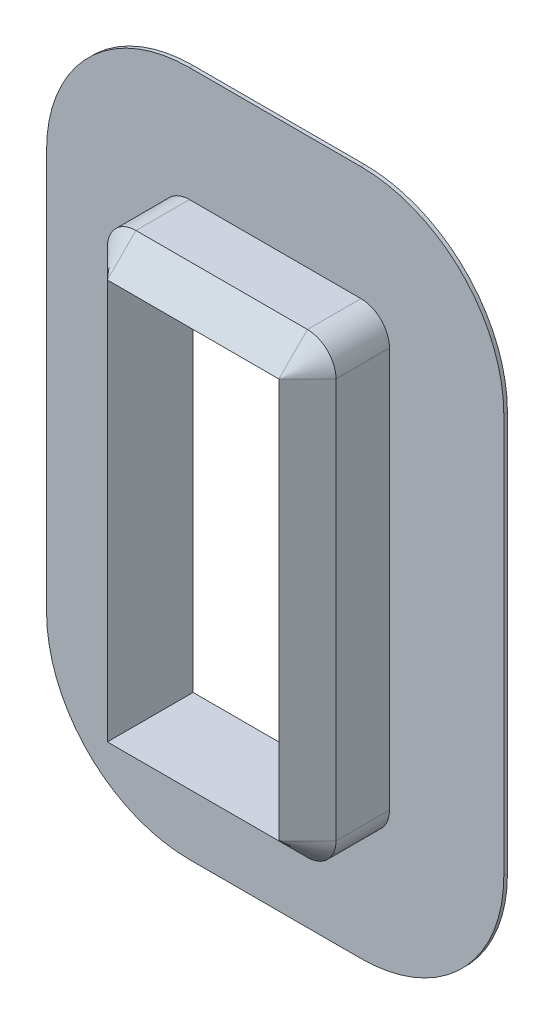
ISO-10303-21;
HEADER;
FILE_DESCRIPTION(('STEP AP214'),'2;1');
FILE_NAME('part.step','',(''),(''),'','','');
FILE_SCHEMA(('AUTOMOTIVE_DESIGN { 1 0 10303 214 1 1 1 1 }'));
ENDSEC;
DATA;
#1=APPLICATION_CONTEXT('core data for automotive mechanical design processes');
#2=APPLICATION_PROTOCOL_DEFINITION('international standard','automotive_design',2000,#1);
#3=PRODUCT_CONTEXT('',#1,'mechanical');
#4=PRODUCT('Part','Part','',(#3));
#5=PRODUCT_RELATED_PRODUCT_CATEGORY('part','',(#4));
#6=PRODUCT_DEFINITION_FORMATION('','',#4);
#7=PRODUCT_DEFINITION_CONTEXT('part definition',#1,'design');
#8=PRODUCT_DEFINITION('design','',#6,#7);
#9=PRODUCT_DEFINITION_SHAPE('','',#8);
#10=(LENGTH_UNIT() NAMED_UNIT(*) SI_UNIT(.MILLI.,.METRE.));
#11=(NAMED_UNIT(*) PLANE_ANGLE_UNIT() SI_UNIT($,.RADIAN.));
#12=(NAMED_UNIT(*) SI_UNIT($,.STERADIAN.) SOLID_ANGLE_UNIT());
#13=UNCERTAINTY_MEASURE_WITH_UNIT(LENGTH_MEASURE(1.E-05),#10,'distance_accuracy_value','');
#14=(GEOMETRIC_REPRESENTATION_CONTEXT(3) GLOBAL_UNCERTAINTY_ASSIGNED_CONTEXT((#13)) GLOBAL_UNIT_ASSIGNED_CONTEXT((#10,
#11,#12)) REPRESENTATION_CONTEXT('',''));
#15=CARTESIAN_POINT('',(0.,0.,0.));
#16=DIRECTION('',(0.,0.,1.));
#17=DIRECTION('',(1.,0.,0.));
#18=AXIS2_PLACEMENT_3D('',#15,#16,#17);
#19=CARTESIAN_POINT('',(0.,146.05,9.525));
#20=DIRECTION('',(0.,1.,0.));
#21=DIRECTION('',(0.,0.,1.));
#22=AXIS2_PLACEMENT_3D('',#19,#20,#21);
#23=PLANE('',#22);
#24=DIRECTION('',(0.,0.,-1.));
#25=VECTOR('',#24,1.);
#26=CARTESIAN_POINT('',(-9.52499999999998,146.05,9.525));
#27=LINE('',#26,#25);
#28=CARTESIAN_POINT('',(-9.52499999999998,146.05,6.35));
#29=VERTEX_POINT('',#28);
#30=CARTESIAN_POINT('',(-9.52499999999998,146.05,0.));
#31=VERTEX_POINT('',#30);
#32=EDGE_CURVE('E266',#29,#31,#27,.T.);
#33=ORIENTED_EDGE('',*,*,#32,.F.);
#34=DIRECTION('',(1.,0.,0.));
#35=VECTOR('',#34,1.);
#36=CARTESIAN_POINT('',(0.,146.05,6.35));
#37=LINE('',#36,#35);
#38=CARTESIAN_POINT('',(9.52499999999997,146.05,6.35));
#39=VERTEX_POINT('',#38);
#40=EDGE_CURVE('E12',#29,#39,#37,.T.);
#41=ORIENTED_EDGE('',*,*,#40,.T.);
#42=DIRECTION('',(0.,0.,-1.));
#43=VECTOR('',#42,1.);
#44=CARTESIAN_POINT('',(9.52499999999997,146.05,9.525));
#45=LINE('',#44,#43);
#46=CARTESIAN_POINT('',(9.52499999999997,146.05,0.));
#47=VERTEX_POINT('',#46);
#48=EDGE_CURVE('E158',#39,#47,#45,.T.);
#49=ORIENTED_EDGE('',*,*,#48,.T.);
#50=DIRECTION('',(1.,0.,0.));
#51=VECTOR('',#50,1.);
#52=CARTESIAN_POINT('',(0.,146.05,0.));
#53=LINE('',#52,#51);
#54=EDGE_CURVE('E219',#31,#47,#53,.T.);
#55=ORIENTED_EDGE('',*,*,#54,.F.);
#56=EDGE_LOOP('',(#33,#41,#49,#55));
#57=FACE_BOUND('',#56,.T.);
#58=ADVANCED_FACE('F56',(#57),#23,.T.);
#59=CARTESIAN_POINT('',(-9.52500000000001,142.875,9.525));
#60=DIRECTION('',(0.,0.,-1.));
#61=DIRECTION('',(-1.,0.,0.));
#62=AXIS2_PLACEMENT_3D('',#59,#60,#61);
#63=CYLINDRICAL_SURFACE('',#62,3.17500000000001);
#64=DIRECTION('',(0.,0.,-1.));
#65=VECTOR('',#64,1.);
#66=CARTESIAN_POINT('',(-12.7,142.875,9.525));
#67=LINE('',#66,#65);
#68=CARTESIAN_POINT('',(-12.7,142.875,6.35));
#69=VERTEX_POINT('',#68);
#70=CARTESIAN_POINT('',(-12.7,142.875,0.));
#71=VERTEX_POINT('',#70);
#72=EDGE_CURVE('E263',#69,#71,#67,.T.);
#73=ORIENTED_EDGE('',*,*,#72,.F.);
#74=CARTESIAN_POINT('',(-9.52500000000001,142.875,6.35));
#75=DIRECTION('',(0.,0.,1.));
#76=DIRECTION('',(1.,0.,0.));
#77=AXIS2_PLACEMENT_3D('',#74,#75,#76);
#78=CIRCLE('',#77,3.17500000000001);
#79=EDGE_CURVE('E67',#69,#29,#78,.F.);
#80=ORIENTED_EDGE('',*,*,#79,.T.);
#81=ORIENTED_EDGE('',*,*,#32,.T.);
#82=CARTESIAN_POINT('',(-9.52500000000001,142.875,0.));
#83=DIRECTION('',(0.,0.,1.));
#84=DIRECTION('',(1.,0.,0.));
#85=AXIS2_PLACEMENT_3D('',#82,#83,#84);
#86=CIRCLE('',#85,3.17500000000001);
#87=EDGE_CURVE('E223',#31,#71,#86,.T.);
#88=ORIENTED_EDGE('',*,*,#87,.T.);
#89=EDGE_LOOP('',(#73,#80,#81,#88));
#90=FACE_BOUND('',#89,.T.);
#91=ADVANCED_FACE('F339',(#90),#63,.T.);
#92=CARTESIAN_POINT('',(-12.7,0.,9.525));
#93=DIRECTION('',(1.,0.,0.));
#94=DIRECTION('',(0.,1.,0.));
#95=AXIS2_PLACEMENT_3D('',#92,#93,#94);
#96=PLANE('',#95);
#97=DIRECTION('',(0.,0.,-1.));
#98=VECTOR('',#97,1.);
#99=CARTESIAN_POINT('',(-12.7,98.425,9.525));
#100=LINE('',#99,#98);
#101=CARTESIAN_POINT('',(-12.7,98.425,6.35));
#102=VERTEX_POINT('',#101);
#103=CARTESIAN_POINT('',(-12.7,98.425,0.));
#104=VERTEX_POINT('',#103);
#105=EDGE_CURVE('E260',#102,#104,#100,.T.);
#106=ORIENTED_EDGE('',*,*,#105,.F.);
#107=DIRECTION('',(0.,1.,0.));
#108=VECTOR('',#107,1.);
#109=CARTESIAN_POINT('',(-12.7,142.875,6.35));
#110=LINE('',#109,#108);
#111=EDGE_CURVE('E289',#102,#69,#110,.T.);
#112=ORIENTED_EDGE('',*,*,#111,.T.);
#113=ORIENTED_EDGE('',*,*,#72,.T.);
#114=DIRECTION('',(0.,-1.,0.));
#115=VECTOR('',#114,1.);
#116=CARTESIAN_POINT('',(-12.7,0.,0.));
#117=LINE('',#116,#115);
#118=EDGE_CURVE('E227',#71,#104,#117,.T.);
#119=ORIENTED_EDGE('',*,*,#118,.T.);
#120=EDGE_LOOP('',(#106,#112,#113,#119));
#121=FACE_BOUND('',#120,.T.);
#122=ADVANCED_FACE('F344',(#121),#96,.F.);
#123=CARTESIAN_POINT('',(-9.525,98.425,9.525));
#124=DIRECTION('',(0.,0.,-1.));
#125=DIRECTION('',(-1.,0.,0.));
#126=AXIS2_PLACEMENT_3D('',#123,#124,#125);
#127=CYLINDRICAL_SURFACE('',#126,3.175);
#128=DIRECTION('',(0.,0.,-1.));
#129=VECTOR('',#128,1.);
#130=CARTESIAN_POINT('',(-9.52499999999998,95.25,9.525));
#131=LINE('',#130,#129);
#132=CARTESIAN_POINT('',(-9.52499999999998,95.25,6.35));
#133=VERTEX_POINT('',#132);
#134=CARTESIAN_POINT('',(-9.52499999999998,95.25,0.));
#135=VERTEX_POINT('',#134);
#136=EDGE_CURVE('E257',#133,#135,#131,.T.);
#137=ORIENTED_EDGE('',*,*,#136,.F.);
#138=CARTESIAN_POINT('',(-9.525,98.425,6.35));
#139=DIRECTION('',(0.,0.,1.));
#140=DIRECTION('',(1.,0.,0.));
#141=AXIS2_PLACEMENT_3D('',#138,#139,#140);
#142=CIRCLE('',#141,3.175);
#143=EDGE_CURVE('E283',#133,#102,#142,.F.);
#144=ORIENTED_EDGE('',*,*,#143,.T.);
#145=ORIENTED_EDGE('',*,*,#105,.T.);
#146=CARTESIAN_POINT('',(-9.525,98.425,0.));
#147=DIRECTION('',(0.,0.,1.));
#148=DIRECTION('',(1.,0.,0.));
#149=AXIS2_PLACEMENT_3D('',#146,#147,#148);
#150=CIRCLE('',#149,3.175);
#151=EDGE_CURVE('E231',#104,#135,#150,.T.);
#152=ORIENTED_EDGE('',*,*,#151,.T.);
#153=EDGE_LOOP('',(#137,#144,#145,#152));
#154=FACE_BOUND('',#153,.T.);
#155=ADVANCED_FACE('F377',(#154),#127,.T.);
#156=CARTESIAN_POINT('',(0.,95.25,9.525));
#157=DIRECTION('',(0.,1.,0.));
#158=DIRECTION('',(0.,0.,1.));
#159=AXIS2_PLACEMENT_3D('',#156,#157,#158);
#160=PLANE('',#159);
#161=DIRECTION('',(0.,0.,-1.));
#162=VECTOR('',#161,1.);
#163=CARTESIAN_POINT('',(9.52499999999998,95.25,9.525));
#164=LINE('',#163,#162);
#165=CARTESIAN_POINT('',(9.52499999999998,95.25,6.35));
#166=VERTEX_POINT('',#165);
#167=CARTESIAN_POINT('',(9.52499999999998,95.25,0.));
#168=VERTEX_POINT('',#167);
#169=EDGE_CURVE('E254',#166,#168,#164,.T.);
#170=ORIENTED_EDGE('',*,*,#169,.F.);
#171=DIRECTION('',(-1.,0.,0.));
#172=VECTOR('',#171,1.);
#173=CARTESIAN_POINT('',(-9.52499999999998,95.25,6.35));
#174=LINE('',#173,#172);
#175=EDGE_CURVE('E269',#166,#133,#174,.T.);
#176=ORIENTED_EDGE('',*,*,#175,.T.);
#177=ORIENTED_EDGE('',*,*,#136,.T.);
#178=DIRECTION('',(1.,0.,0.));
#179=VECTOR('',#178,1.);
#180=CARTESIAN_POINT('',(0.,95.25,0.));
#181=LINE('',#180,#179);
#182=EDGE_CURVE('E235',#135,#168,#181,.T.);
#183=ORIENTED_EDGE('',*,*,#182,.T.);
#184=EDGE_LOOP('',(#170,#176,#177,#183));
#185=FACE_BOUND('',#184,.T.);
#186=ADVANCED_FACE('F380',(#185),#160,.F.);
#187=CARTESIAN_POINT('',(9.52500000000001,98.425,9.525));
#188=DIRECTION('',(0.,0.,-1.));
#189=DIRECTION('',(-1.,0.,0.));
#190=AXIS2_PLACEMENT_3D('',#187,#188,#189);
#191=CYLINDRICAL_SURFACE('',#190,3.175);
#192=DIRECTION('',(0.,0.,-1.));
#193=VECTOR('',#192,1.);
#194=CARTESIAN_POINT('',(12.7,98.425,9.525));
#195=LINE('',#194,#193);
#196=CARTESIAN_POINT('',(12.7,98.425,6.35));
#197=VERTEX_POINT('',#196);
#198=CARTESIAN_POINT('',(12.7,98.425,0.));
#199=VERTEX_POINT('',#198);
#200=EDGE_CURVE('E251',#197,#199,#195,.T.);
#201=ORIENTED_EDGE('',*,*,#200,.F.);
#202=CARTESIAN_POINT('',(9.52500000000001,98.425,6.35));
#203=DIRECTION('',(0.,0.,1.));
#204=DIRECTION('',(1.,0.,0.));
#205=AXIS2_PLACEMENT_3D('',#202,#203,#204);
#206=CIRCLE('',#205,3.175);
#207=EDGE_CURVE('E280',#197,#166,#206,.F.);
#208=ORIENTED_EDGE('',*,*,#207,.T.);
#209=ORIENTED_EDGE('',*,*,#169,.T.);
#210=CARTESIAN_POINT('',(9.52500000000001,98.425,0.));
#211=DIRECTION('',(0.,0.,1.));
#212=DIRECTION('',(1.,0.,0.));
#213=AXIS2_PLACEMENT_3D('',#210,#211,#212);
#214=CIRCLE('',#213,3.175);
#215=EDGE_CURVE('E239',#168,#199,#214,.T.);
#216=ORIENTED_EDGE('',*,*,#215,.T.);
#217=EDGE_LOOP('',(#201,#208,#209,#216));
#218=FACE_BOUND('',#217,.T.);
#219=ADVANCED_FACE('F328',(#218),#191,.T.);
#220=CARTESIAN_POINT('',(12.7,0.,9.525));
#221=DIRECTION('',(1.,0.,0.));
#222=DIRECTION('',(0.,1.,0.));
#223=AXIS2_PLACEMENT_3D('',#220,#221,#222);
#224=PLANE('',#223);
#225=DIRECTION('',(0.,0.,-1.));
#226=VECTOR('',#225,1.);
#227=CARTESIAN_POINT('',(12.7,142.875,9.525));
#228=LINE('',#227,#226);
#229=CARTESIAN_POINT('',(12.7,142.875,6.35));
#230=VERTEX_POINT('',#229);
#231=CARTESIAN_POINT('',(12.7,142.875,0.));
#232=VERTEX_POINT('',#231);
#233=EDGE_CURVE('E248',#230,#232,#228,.T.);
#234=ORIENTED_EDGE('',*,*,#233,.F.);
#235=DIRECTION('',(0.,-1.,0.));
#236=VECTOR('',#235,1.);
#237=CARTESIAN_POINT('',(12.7,0.,6.35));
#238=LINE('',#237,#236);
#239=EDGE_CURVE('E286',#230,#197,#238,.T.);
#240=ORIENTED_EDGE('',*,*,#239,.T.);
#241=ORIENTED_EDGE('',*,*,#200,.T.);
#242=DIRECTION('',(0.,-1.,0.));
#243=VECTOR('',#242,1.);
#244=CARTESIAN_POINT('',(12.7,0.,0.));
#245=LINE('',#244,#243);
#246=EDGE_CURVE('E195',#232,#199,#245,.T.);
#247=ORIENTED_EDGE('',*,*,#246,.F.);
#248=EDGE_LOOP('',(#234,#240,#241,#247));
#249=FACE_BOUND('',#248,.T.);
#250=ADVANCED_FACE('F325',(#249),#224,.T.);
#251=CARTESIAN_POINT('',(-9.52500000000001,0.,9.525));
#252=DIRECTION('',(1.,0.,0.));
#253=DIRECTION('',(0.,0.,-1.));
#254=AXIS2_PLACEMENT_3D('',#251,#252,#253);
#255=PLANE('',#254);
#256=DIRECTION('',(0.,-1.,0.));
#257=VECTOR('',#256,1.);
#258=CARTESIAN_POINT('',(-9.52500000000001,0.,0.));
#259=LINE('',#258,#257);
#260=CARTESIAN_POINT('',(-9.52500000000001,142.875,0.));
#261=VERTEX_POINT('',#260);
#262=CARTESIAN_POINT('',(-9.52500000000001,98.425,0.));
#263=VERTEX_POINT('',#262);
#264=EDGE_CURVE('E154',#261,#263,#259,.T.);
#265=ORIENTED_EDGE('',*,*,#264,.F.);
#266=DIRECTION('',(0.,0.,-1.));
#267=VECTOR('',#266,1.);
#268=CARTESIAN_POINT('',(-9.52500000000001,142.875,9.525));
#269=LINE('',#268,#267);
#270=CARTESIAN_POINT('',(-9.52500000000001,142.875,9.525));
#271=VERTEX_POINT('',#270);
#272=EDGE_CURVE('E147',#271,#261,#269,.T.);
#273=ORIENTED_EDGE('',*,*,#272,.F.);
#274=DIRECTION('',(0.,-1.,0.));
#275=VECTOR('',#274,1.);
#276=CARTESIAN_POINT('',(-9.52500000000001,0.,9.525));
#277=LINE('',#276,#275);
#278=CARTESIAN_POINT('',(-9.52500000000001,98.425,9.525));
#279=VERTEX_POINT('',#278);
#280=EDGE_CURVE('E151',#271,#279,#277,.T.);
#281=ORIENTED_EDGE('',*,*,#280,.T.);
#282=DIRECTION('',(0.,0.,-1.));
#283=VECTOR('',#282,1.);
#284=CARTESIAN_POINT('',(-9.52500000000001,98.425,9.525));
#285=LINE('',#284,#283);
#286=EDGE_CURVE('E205',#279,#263,#285,.T.);
#287=ORIENTED_EDGE('',*,*,#286,.T.);
#288=EDGE_LOOP('',(#265,#273,#281,#287));
#289=FACE_BOUND('',#288,.T.);
#290=ADVANCED_FACE('F149',(#289),#255,.T.);
#291=CARTESIAN_POINT('',(0.,142.875,9.525));
#292=DIRECTION('',(0.,1.,0.));
#293=DIRECTION('',(0.,0.,1.));
#294=AXIS2_PLACEMENT_3D('',#291,#292,#293);
#295=PLANE('',#294);
#296=DIRECTION('',(1.,0.,0.));
#297=VECTOR('',#296,1.);
#298=CARTESIAN_POINT('',(0.,142.875,0.));
#299=LINE('',#298,#297);
#300=CARTESIAN_POINT('',(9.525,142.875,0.));
#301=VERTEX_POINT('',#300);
#302=EDGE_CURVE('E208',#261,#301,#299,.T.);
#303=ORIENTED_EDGE('',*,*,#302,.T.);
#304=DIRECTION('',(0.,0.,-1.));
#305=VECTOR('',#304,1.);
#306=CARTESIAN_POINT('',(9.525,142.875,9.525));
#307=LINE('',#306,#305);
#308=CARTESIAN_POINT('',(9.525,142.875,9.525));
#309=VERTEX_POINT('',#308);
#310=EDGE_CURVE('E159',#309,#301,#307,.T.);
#311=ORIENTED_EDGE('',*,*,#310,.F.);
#312=DIRECTION('',(1.,0.,0.));
#313=VECTOR('',#312,1.);
#314=CARTESIAN_POINT('',(0.,142.875,9.525));
#315=LINE('',#314,#313);
#316=EDGE_CURVE('E162',#271,#309,#315,.T.);
#317=ORIENTED_EDGE('',*,*,#316,.F.);
#318=ORIENTED_EDGE('',*,*,#272,.T.);
#319=EDGE_LOOP('',(#303,#311,#317,#318));
#320=FACE_BOUND('',#319,.T.);
#321=ADVANCED_FACE('F164',(#320),#295,.F.);
#322=CARTESIAN_POINT('',(9.52499999999995,0.,9.525));
#323=DIRECTION('',(1.,0.,0.));
#324=DIRECTION('',(0.,1.,0.));
#325=AXIS2_PLACEMENT_3D('',#322,#323,#324);
#326=PLANE('',#325);
#327=DIRECTION('',(0.,-1.,0.));
#328=VECTOR('',#327,1.);
#329=CARTESIAN_POINT('',(9.52499999999995,0.,0.));
#330=LINE('',#329,#328);
#331=CARTESIAN_POINT('',(9.52499999999998,98.425,0.));
#332=VERTEX_POINT('',#331);
#333=EDGE_CURVE('E211',#301,#332,#330,.T.);
#334=ORIENTED_EDGE('',*,*,#333,.T.);
#335=DIRECTION('',(0.,0.,-1.));
#336=VECTOR('',#335,1.);
#337=CARTESIAN_POINT('',(9.52499999999998,98.425,9.525));
#338=LINE('',#337,#336);
#339=CARTESIAN_POINT('',(9.52499999999998,98.425,9.525));
#340=VERTEX_POINT('',#339);
#341=EDGE_CURVE('E272',#340,#332,#338,.T.);
#342=ORIENTED_EDGE('',*,*,#341,.F.);
#343=DIRECTION('',(0.,-1.,0.));
#344=VECTOR('',#343,1.);
#345=CARTESIAN_POINT('',(9.52499999999995,0.,9.525));
#346=LINE('',#345,#344);
#347=EDGE_CURVE('E171',#309,#340,#346,.T.);
#348=ORIENTED_EDGE('',*,*,#347,.F.);
#349=ORIENTED_EDGE('',*,*,#310,.T.);
#350=EDGE_LOOP('',(#334,#342,#348,#349));
#351=FACE_BOUND('',#350,.T.);
#352=ADVANCED_FACE('F359',(#351),#326,.F.);
#353=CARTESIAN_POINT('',(1.43403807347416E-13,98.425,9.525));
#354=DIRECTION('',(0.,1.,0.));
#355=DIRECTION('',(-1.,0.,0.));
#356=AXIS2_PLACEMENT_3D('',#353,#354,#355);
#357=PLANE('',#356);
#358=DIRECTION('',(1.,0.,0.));
#359=VECTOR('',#358,1.);
#360=CARTESIAN_POINT('',(1.43403807347416E-13,98.425,0.));
#361=LINE('',#360,#359);
#362=EDGE_CURVE('E215',#263,#332,#361,.T.);
#363=ORIENTED_EDGE('',*,*,#362,.F.);
#364=ORIENTED_EDGE('',*,*,#286,.F.);
#365=DIRECTION('',(1.,0.,0.));
#366=VECTOR('',#365,1.);
#367=CARTESIAN_POINT('',(1.43403807347416E-13,98.425,9.525));
#368=LINE('',#367,#366);
#369=EDGE_CURVE('E201',#279,#340,#368,.T.);
#370=ORIENTED_EDGE('',*,*,#369,.T.);
#371=ORIENTED_EDGE('',*,*,#341,.T.);
#372=EDGE_LOOP('',(#363,#364,#370,#371));
#373=FACE_BOUND('',#372,.T.);
#374=ADVANCED_FACE('F355',(#373),#357,.T.);
#375=CARTESIAN_POINT('',(9.52499999999999,142.875,9.525));
#376=DIRECTION('',(0.,0.,-1.));
#377=DIRECTION('',(-1.,0.,0.));
#378=AXIS2_PLACEMENT_3D('',#375,#376,#377);
#379=CYLINDRICAL_SURFACE('',#378,3.17500000000001);
#380=ORIENTED_EDGE('',*,*,#48,.F.);
#381=CARTESIAN_POINT('',(9.52499999999999,142.875,6.35));
#382=DIRECTION('',(0.,0.,1.));
#383=DIRECTION('',(1.,0.,0.));
#384=AXIS2_PLACEMENT_3D('',#381,#382,#383);
#385=CIRCLE('',#384,3.17500000000001);
#386=EDGE_CURVE('E292',#39,#230,#385,.F.);
#387=ORIENTED_EDGE('',*,*,#386,.T.);
#388=ORIENTED_EDGE('',*,*,#233,.T.);
#389=CARTESIAN_POINT('',(9.52499999999999,142.875,0.));
#390=DIRECTION('',(0.,0.,1.));
#391=DIRECTION('',(1.,0.,0.));
#392=AXIS2_PLACEMENT_3D('',#389,#390,#391);
#393=CIRCLE('',#392,3.17500000000001);
#394=EDGE_CURVE('E191',#232,#47,#393,.T.);
#395=ORIENTED_EDGE('',*,*,#394,.T.);
#396=EDGE_LOOP('',(#380,#387,#388,#395));
#397=FACE_BOUND('',#396,.T.);
#398=ADVANCED_FACE('F338',(#397),#379,.T.);
#399=CARTESIAN_POINT('',(0.,0.,0.));
#400=DIRECTION('',(0.,0.,1.));
#401=DIRECTION('',(1.,0.,0.));
#402=AXIS2_PLACEMENT_3D('',#399,#400,#401);
#403=PLANE('',#402);
#404=ORIENTED_EDGE('',*,*,#264,.T.);
#405=ORIENTED_EDGE('',*,*,#362,.T.);
#406=ORIENTED_EDGE('',*,*,#333,.F.);
#407=ORIENTED_EDGE('',*,*,#302,.F.);
#408=EDGE_LOOP('',(#404,#405,#406,#407));
#409=FACE_BOUND('',#408,.T.);
#410=ORIENTED_EDGE('',*,*,#54,.T.);
#411=ORIENTED_EDGE('',*,*,#394,.F.);
#412=ORIENTED_EDGE('',*,*,#246,.T.);
#413=ORIENTED_EDGE('',*,*,#215,.F.);
#414=ORIENTED_EDGE('',*,*,#182,.F.);
#415=ORIENTED_EDGE('',*,*,#151,.F.);
#416=ORIENTED_EDGE('',*,*,#118,.F.);
#417=ORIENTED_EDGE('',*,*,#87,.F.);
#418=EDGE_LOOP('',(#410,#411,#412,#413,#414,#415,#416,#417));
#419=FACE_BOUND('',#418,.T.);
#420=ADVANCED_FACE('F334',(#409,#419),#403,.F.);
#421=CARTESIAN_POINT('',(0.,146.05,6.35));
#422=DIRECTION('',(0.,-0.707106781186546,-0.707106781186549));
#423=DIRECTION('',(1.,0.,0.));
#424=AXIS2_PLACEMENT_3D('',#421,#422,#423);
#425=PLANE('',#424);
#426=DIRECTION('',(0.,-0.707106781186549,0.707106781186546));
#427=VECTOR('',#426,1.);
#428=CARTESIAN_POINT('',(9.52499999999997,146.05,6.35));
#429=LINE('',#428,#427);
#430=EDGE_CURVE('E177',#39,#309,#429,.T.);
#431=ORIENTED_EDGE('',*,*,#430,.F.);
#432=ORIENTED_EDGE('',*,*,#40,.F.);
#433=DIRECTION('',(0.,0.707106781186549,-0.707106781186546));
#434=VECTOR('',#433,1.);
#435=CARTESIAN_POINT('',(-9.52500000000001,142.875,9.525));
#436=LINE('',#435,#434);
#437=EDGE_CURVE('E61',#271,#29,#436,.T.);
#438=ORIENTED_EDGE('',*,*,#437,.F.);
#439=ORIENTED_EDGE('',*,*,#316,.T.);
#440=EDGE_LOOP('',(#431,#432,#438,#439));
#441=FACE_BOUND('',#440,.T.);
#442=ADVANCED_FACE('F59',(#441),#425,.F.);
#443=CARTESIAN_POINT('',(-9.52500000000001,142.875,6.35));
#444=DIRECTION('',(0.,0.,-1.));
#445=DIRECTION('',(-1.,0.,0.));
#446=AXIS2_PLACEMENT_3D('',#443,#444,#445);
#447=CONICAL_SURFACE('',#446,3.17500000000001,0.78539816339745);
#448=ORIENTED_EDGE('',*,*,#437,.T.);
#449=ORIENTED_EDGE('',*,*,#79,.F.);
#450=DIRECTION('',(-0.707106781186549,0.,-0.707106781186546));
#451=VECTOR('',#450,1.);
#452=CARTESIAN_POINT('',(-9.525,142.875,9.525));
#453=LINE('',#452,#451);
#454=EDGE_CURVE('E179',#271,#69,#453,.T.);
#455=ORIENTED_EDGE('',*,*,#454,.F.);
#456=EDGE_LOOP('',(#448,#449,#455));
#457=FACE_BOUND('',#456,.T.);
#458=ADVANCED_FACE('F180',(#457),#447,.T.);
#459=CARTESIAN_POINT('',(9.52499999999999,142.875,6.35));
#460=DIRECTION('',(0.,0.,-1.));
#461=DIRECTION('',(-1.,0.,0.));
#462=AXIS2_PLACEMENT_3D('',#459,#460,#461);
#463=CONICAL_SURFACE('',#462,3.17500000000001,0.78539816339745);
#464=ORIENTED_EDGE('',*,*,#386,.F.);
#465=ORIENTED_EDGE('',*,*,#430,.T.);
#466=DIRECTION('',(-0.707106781186549,0.,0.707106781186546));
#467=VECTOR('',#466,1.);
#468=CARTESIAN_POINT('',(12.7,142.875,6.35));
#469=LINE('',#468,#467);
#470=EDGE_CURVE('E184',#230,#309,#469,.T.);
#471=ORIENTED_EDGE('',*,*,#470,.F.);
#472=EDGE_LOOP('',(#464,#465,#471));
#473=FACE_BOUND('',#472,.T.);
#474=ADVANCED_FACE('F315',(#473),#463,.T.);
#475=CARTESIAN_POINT('',(-9.52499999999997,0.,9.525));
#476=DIRECTION('',(-0.707106781186546,0.,0.707106781186549));
#477=DIRECTION('',(0.,1.,0.));
#478=AXIS2_PLACEMENT_3D('',#475,#476,#477);
#479=PLANE('',#478);
#480=ORIENTED_EDGE('',*,*,#454,.T.);
#481=ORIENTED_EDGE('',*,*,#111,.F.);
#482=DIRECTION('',(-0.707106781186549,0.,-0.707106781186546));
#483=VECTOR('',#482,1.);
#484=CARTESIAN_POINT('',(-9.52499999999999,98.425,9.525));
#485=LINE('',#484,#483);
#486=EDGE_CURVE('E188',#279,#102,#485,.T.);
#487=ORIENTED_EDGE('',*,*,#486,.F.);
#488=ORIENTED_EDGE('',*,*,#280,.F.);
#489=EDGE_LOOP('',(#480,#481,#487,#488));
#490=FACE_BOUND('',#489,.T.);
#491=ADVANCED_FACE('F186',(#490),#479,.T.);
#492=CARTESIAN_POINT('',(12.7,0.,6.35));
#493=DIRECTION('',(-0.707106781186546,0.,-0.707106781186549));
#494=DIRECTION('',(0.,-1.,0.));
#495=AXIS2_PLACEMENT_3D('',#492,#493,#494);
#496=PLANE('',#495);
#497=ORIENTED_EDGE('',*,*,#470,.T.);
#498=ORIENTED_EDGE('',*,*,#347,.T.);
#499=DIRECTION('',(-0.707106781186549,0.,0.707106781186546));
#500=VECTOR('',#499,1.);
#501=CARTESIAN_POINT('',(12.7,98.425,6.35));
#502=LINE('',#501,#500);
#503=EDGE_CURVE('E303',#197,#340,#502,.T.);
#504=ORIENTED_EDGE('',*,*,#503,.F.);
#505=ORIENTED_EDGE('',*,*,#239,.F.);
#506=EDGE_LOOP('',(#497,#498,#504,#505));
#507=FACE_BOUND('',#506,.T.);
#508=ADVANCED_FACE('F318',(#507),#496,.F.);
#509=CARTESIAN_POINT('',(-9.525,98.425,6.35));
#510=DIRECTION('',(0.,0.,-1.));
#511=DIRECTION('',(-1.,0.,0.));
#512=AXIS2_PLACEMENT_3D('',#509,#510,#511);
#513=CONICAL_SURFACE('',#512,3.17500000000001,0.78539816339745);
#514=ORIENTED_EDGE('',*,*,#486,.T.);
#515=ORIENTED_EDGE('',*,*,#143,.F.);
#516=DIRECTION('',(0.,-0.707106781186549,-0.707106781186546));
#517=VECTOR('',#516,1.);
#518=CARTESIAN_POINT('',(-9.52499999999998,98.425,9.525));
#519=LINE('',#518,#517);
#520=EDGE_CURVE('E300',#279,#133,#519,.T.);
#521=ORIENTED_EDGE('',*,*,#520,.F.);
#522=EDGE_LOOP('',(#514,#515,#521));
#523=FACE_BOUND('',#522,.T.);
#524=ADVANCED_FACE('F347',(#523),#513,.T.);
#525=CARTESIAN_POINT('',(9.52500000000001,98.425,6.35));
#526=DIRECTION('',(0.,0.,-1.));
#527=DIRECTION('',(-1.,0.,0.));
#528=AXIS2_PLACEMENT_3D('',#525,#526,#527);
#529=CONICAL_SURFACE('',#528,3.17500000000001,0.78539816339745);
#530=ORIENTED_EDGE('',*,*,#207,.F.);
#531=ORIENTED_EDGE('',*,*,#503,.T.);
#532=DIRECTION('',(0.,0.707106781186549,0.707106781186546));
#533=VECTOR('',#532,1.);
#534=CARTESIAN_POINT('',(9.52499999999998,95.25,6.35));
#535=LINE('',#534,#533);
#536=EDGE_CURVE('E297',#166,#340,#535,.T.);
#537=ORIENTED_EDGE('',*,*,#536,.F.);
#538=EDGE_LOOP('',(#530,#531,#537));
#539=FACE_BOUND('',#538,.T.);
#540=ADVANCED_FACE('F425',(#539),#529,.T.);
#541=CARTESIAN_POINT('',(0.,98.425,9.525));
#542=DIRECTION('',(0.,-0.707106781186546,0.707106781186549));
#543=DIRECTION('',(-1.,0.,0.));
#544=AXIS2_PLACEMENT_3D('',#541,#542,#543);
#545=PLANE('',#544);
#546=ORIENTED_EDGE('',*,*,#520,.T.);
#547=ORIENTED_EDGE('',*,*,#175,.F.);
#548=ORIENTED_EDGE('',*,*,#536,.T.);
#549=ORIENTED_EDGE('',*,*,#369,.F.);
#550=EDGE_LOOP('',(#546,#547,#548,#549));
#551=FACE_BOUND('',#550,.T.);
#552=ADVANCED_FACE('F351',(#551),#545,.T.);
#553=CLOSED_SHELL('',(#58,#91,#122,#155,#186,#219,#250,#290,#321,#352,#374,#398,#420,#442,#458,
#474,#491,#508,#524,#540,#552));
#554=MANIFOLD_SOLID_BREP('B2',#553);
#555=CARTESIAN_POINT('',(-9.52500000000001,142.875,0.4064));
#556=DIRECTION('',(0.,0.,-1.));
#557=DIRECTION('',(-1.,0.,0.));
#558=AXIS2_PLACEMENT_3D('',#555,#556,#557);
#559=PLANE('',#558);
#560=CARTESIAN_POINT('',(-9.52500000000001,142.875,0.4064));
#561=DIRECTION('',(0.,0.,1.));
#562=DIRECTION('',(-1.,0.,0.));
#563=AXIS2_PLACEMENT_3D('',#560,#561,#562);
#564=CIRCLE('',#563,15.875);
#565=CARTESIAN_POINT('',(-9.52499999999989,158.75,0.4064));
#566=VERTEX_POINT('',#565);
#567=CARTESIAN_POINT('',(-25.4,142.875,0.4064));
#568=VERTEX_POINT('',#567);
#569=EDGE_CURVE('E778',#566,#568,#564,.T.);
#570=ORIENTED_EDGE('',*,*,#569,.T.);
#571=DIRECTION('',(0.,-1.,0.));
#572=VECTOR('',#571,1.);
#573=CARTESIAN_POINT('',(-25.4,142.875,0.4064));
#574=LINE('',#573,#572);
#575=CARTESIAN_POINT('',(-25.4,98.4250000000001,0.4064));
#576=VERTEX_POINT('',#575);
#577=EDGE_CURVE('E781',#568,#576,#574,.T.);
#578=ORIENTED_EDGE('',*,*,#577,.T.);
#579=CARTESIAN_POINT('',(-9.525,98.425,0.4064));
#580=DIRECTION('',(0.,0.,1.));
#581=DIRECTION('',(1.,0.,0.));
#582=AXIS2_PLACEMENT_3D('',#579,#580,#581);
#583=CIRCLE('',#582,15.875);
#584=CARTESIAN_POINT('',(-9.52499999999998,82.55,0.4064));
#585=VERTEX_POINT('',#584);
#586=EDGE_CURVE('E784',#576,#585,#583,.T.);
#587=ORIENTED_EDGE('',*,*,#586,.T.);
#588=DIRECTION('',(1.,0.,0.));
#589=VECTOR('',#588,1.);
#590=CARTESIAN_POINT('',(-9.52499999999998,82.55,0.4064));
#591=LINE('',#590,#589);
#592=CARTESIAN_POINT('',(9.52499999999989,82.55,0.4064));
#593=VERTEX_POINT('',#592);
#594=EDGE_CURVE('E786',#585,#593,#591,.T.);
#595=ORIENTED_EDGE('',*,*,#594,.T.);
#596=CARTESIAN_POINT('',(9.52500000000001,98.425,0.4064));
#597=DIRECTION('',(0.,0.,1.));
#598=DIRECTION('',(-1.,0.,0.));
#599=AXIS2_PLACEMENT_3D('',#596,#597,#598);
#600=CIRCLE('',#599,15.875);
#601=CARTESIAN_POINT('',(25.4,98.425,0.4064));
#602=VERTEX_POINT('',#601);
#603=EDGE_CURVE('E788',#593,#602,#600,.T.);
#604=ORIENTED_EDGE('',*,*,#603,.T.);
#605=DIRECTION('',(0.,1.,0.));
#606=VECTOR('',#605,1.);
#607=CARTESIAN_POINT('',(25.4,142.875,0.4064));
#608=LINE('',#607,#606);
#609=CARTESIAN_POINT('',(25.4,142.875,0.4064));
#610=VERTEX_POINT('',#609);
#611=EDGE_CURVE('E790',#602,#610,#608,.T.);
#612=ORIENTED_EDGE('',*,*,#611,.T.);
#613=CARTESIAN_POINT('',(9.52499999999999,142.875,0.4064));
#614=DIRECTION('',(0.,0.,1.));
#615=DIRECTION('',(-1.,0.,0.));
#616=AXIS2_PLACEMENT_3D('',#613,#614,#615);
#617=CIRCLE('',#616,15.875);
#618=CARTESIAN_POINT('',(9.52499999999997,158.75,0.4064));
#619=VERTEX_POINT('',#618);
#620=EDGE_CURVE('E792',#610,#619,#617,.T.);
#621=ORIENTED_EDGE('',*,*,#620,.T.);
#622=DIRECTION('',(-1.,0.,0.));
#623=VECTOR('',#622,1.);
#624=CARTESIAN_POINT('',(-9.52499999999989,158.75,0.4064));
#625=LINE('',#624,#623);
#626=EDGE_CURVE('E794',#619,#566,#625,.T.);
#627=ORIENTED_EDGE('',*,*,#626,.T.);
#628=EDGE_LOOP('',(#570,#578,#587,#595,#604,#612,#621,#627));
#629=FACE_BOUND('',#628,.T.);
#630=CARTESIAN_POINT('',(9.52499999999999,142.875,0.4064));
#631=DIRECTION('',(0.,0.,1.));
#632=DIRECTION('',(-1.,0.,0.));
#633=AXIS2_PLACEMENT_3D('',#630,#631,#632);
#634=CIRCLE('',#633,3.17500000000001);
#635=CARTESIAN_POINT('',(12.7,142.875,0.4064));
#636=VERTEX_POINT('',#635);
#637=CARTESIAN_POINT('',(9.52499999999997,146.05,0.4064));
#638=VERTEX_POINT('',#637);
#639=EDGE_CURVE('E713',#636,#638,#634,.T.);
#640=ORIENTED_EDGE('',*,*,#639,.F.);
#641=DIRECTION('',(0.,1.,0.));
#642=VECTOR('',#641,1.);
#643=CARTESIAN_POINT('',(12.7,142.875,0.4064));
#644=LINE('',#643,#642);
#645=CARTESIAN_POINT('',(12.7,98.425,0.4064));
#646=VERTEX_POINT('',#645);
#647=EDGE_CURVE('E746',#646,#636,#644,.T.);
#648=ORIENTED_EDGE('',*,*,#647,.F.);
#649=CARTESIAN_POINT('',(9.52500000000001,98.425,0.4064));
#650=DIRECTION('',(0.,0.,1.));
#651=DIRECTION('',(-1.,0.,0.));
#652=AXIS2_PLACEMENT_3D('',#649,#650,#651);
#653=CIRCLE('',#652,3.175);
#654=CARTESIAN_POINT('',(9.52499999999998,95.25,0.4064));
#655=VERTEX_POINT('',#654);
#656=EDGE_CURVE('E744',#655,#646,#653,.T.);
#657=ORIENTED_EDGE('',*,*,#656,.F.);
#658=DIRECTION('',(1.,0.,0.));
#659=VECTOR('',#658,1.);
#660=CARTESIAN_POINT('',(-9.52499999999998,95.25,0.4064));
#661=LINE('',#660,#659);
#662=CARTESIAN_POINT('',(-9.52499999999998,95.25,0.4064));
#663=VERTEX_POINT('',#662);
#664=EDGE_CURVE('E742',#663,#655,#661,.T.);
#665=ORIENTED_EDGE('',*,*,#664,.F.);
#666=CARTESIAN_POINT('',(-9.525,98.425,0.4064));
#667=DIRECTION('',(0.,0.,1.));
#668=DIRECTION('',(1.,0.,0.));
#669=AXIS2_PLACEMENT_3D('',#666,#667,#668);
#670=CIRCLE('',#669,3.175);
#671=CARTESIAN_POINT('',(-12.7,98.425,0.4064));
#672=VERTEX_POINT('',#671);
#673=EDGE_CURVE('E740',#672,#663,#670,.T.);
#674=ORIENTED_EDGE('',*,*,#673,.F.);
#675=DIRECTION('',(0.,-1.,0.));
#676=VECTOR('',#675,1.);
#677=CARTESIAN_POINT('',(-12.7,142.875,0.4064));
#678=LINE('',#677,#676);
#679=CARTESIAN_POINT('',(-12.7,142.875,0.4064));
#680=VERTEX_POINT('',#679);
#681=EDGE_CURVE('E736',#680,#672,#678,.T.);
#682=ORIENTED_EDGE('',*,*,#681,.F.);
#683=CARTESIAN_POINT('',(-9.52500000000001,142.875,0.4064));
#684=DIRECTION('',(0.,0.,1.));
#685=DIRECTION('',(-1.,0.,0.));
#686=AXIS2_PLACEMENT_3D('',#683,#684,#685);
#687=CIRCLE('',#686,3.17500000000001);
#688=CARTESIAN_POINT('',(-9.52499999999998,146.05,0.4064));
#689=VERTEX_POINT('',#688);
#690=EDGE_CURVE('E734',#689,#680,#687,.T.);
#691=ORIENTED_EDGE('',*,*,#690,.F.);
#692=DIRECTION('',(-1.,0.,0.));
#693=VECTOR('',#692,1.);
#694=CARTESIAN_POINT('',(-9.52499999999998,146.05,0.4064));
#695=LINE('',#694,#693);
#696=EDGE_CURVE('E721',#638,#689,#695,.T.);
#697=ORIENTED_EDGE('',*,*,#696,.F.);
#698=EDGE_LOOP('',(#640,#648,#657,#665,#674,#682,#691,#697));
#699=FACE_BOUND('',#698,.T.);
#700=ADVANCED_FACE('F600',(#629,#699),#559,.F.);
#701=CARTESIAN_POINT('',(-9.52500000000001,142.875,0.));
#702=DIRECTION('',(0.,0.,-1.));
#703=DIRECTION('',(-1.,0.,0.));
#704=AXIS2_PLACEMENT_3D('',#701,#702,#703);
#705=PLANE('',#704);
#706=CARTESIAN_POINT('',(-9.52500000000001,142.875,0.));
#707=DIRECTION('',(0.,0.,1.));
#708=DIRECTION('',(-1.,0.,0.));
#709=AXIS2_PLACEMENT_3D('',#706,#707,#708);
#710=CIRCLE('',#709,15.875);
#711=CARTESIAN_POINT('',(-9.52499999999989,158.75,0.));
#712=VERTEX_POINT('',#711);
#713=CARTESIAN_POINT('',(-25.4,142.875,0.));
#714=VERTEX_POINT('',#713);
#715=EDGE_CURVE('E729',#712,#714,#710,.T.);
#716=ORIENTED_EDGE('',*,*,#715,.F.);
#717=DIRECTION('',(-1.,0.,0.));
#718=VECTOR('',#717,1.);
#719=CARTESIAN_POINT('',(-9.52499999999989,158.75,0.));
#720=LINE('',#719,#718);
#721=CARTESIAN_POINT('',(9.52499999999997,158.75,0.));
#722=VERTEX_POINT('',#721);
#723=EDGE_CURVE('E782',#722,#712,#720,.T.);
#724=ORIENTED_EDGE('',*,*,#723,.F.);
#725=CARTESIAN_POINT('',(9.52499999999999,142.875,0.));
#726=DIRECTION('',(0.,0.,1.));
#727=DIRECTION('',(-1.,0.,0.));
#728=AXIS2_PLACEMENT_3D('',#725,#726,#727);
#729=CIRCLE('',#728,15.875);
#730=CARTESIAN_POINT('',(25.4,142.875,0.));
#731=VERTEX_POINT('',#730);
#732=EDGE_CURVE('E809',#731,#722,#729,.T.);
#733=ORIENTED_EDGE('',*,*,#732,.F.);
#734=DIRECTION('',(0.,1.,0.));
#735=VECTOR('',#734,1.);
#736=CARTESIAN_POINT('',(25.4,142.875,0.));
#737=LINE('',#736,#735);
#738=CARTESIAN_POINT('',(25.4,98.425,0.));
#739=VERTEX_POINT('',#738);
#740=EDGE_CURVE('E807',#739,#731,#737,.T.);
#741=ORIENTED_EDGE('',*,*,#740,.F.);
#742=CARTESIAN_POINT('',(9.52500000000001,98.425,0.));
#743=DIRECTION('',(0.,0.,1.));
#744=DIRECTION('',(-1.,0.,0.));
#745=AXIS2_PLACEMENT_3D('',#742,#743,#744);
#746=CIRCLE('',#745,15.875);
#747=CARTESIAN_POINT('',(9.52499999999989,82.55,0.));
#748=VERTEX_POINT('',#747);
#749=EDGE_CURVE('E805',#748,#739,#746,.T.);
#750=ORIENTED_EDGE('',*,*,#749,.F.);
#751=DIRECTION('',(1.,0.,0.));
#752=VECTOR('',#751,1.);
#753=CARTESIAN_POINT('',(-9.52499999999998,82.55,0.));
#754=LINE('',#753,#752);
#755=CARTESIAN_POINT('',(-9.52499999999998,82.55,0.));
#756=VERTEX_POINT('',#755);
#757=EDGE_CURVE('E803',#756,#748,#754,.T.);
#758=ORIENTED_EDGE('',*,*,#757,.F.);
#759=CARTESIAN_POINT('',(-9.525,98.425,0.));
#760=DIRECTION('',(0.,0.,1.));
#761=DIRECTION('',(1.,0.,0.));
#762=AXIS2_PLACEMENT_3D('',#759,#760,#761);
#763=CIRCLE('',#762,15.875);
#764=CARTESIAN_POINT('',(-25.4,98.4250000000001,0.));
#765=VERTEX_POINT('',#764);
#766=EDGE_CURVE('E801',#765,#756,#763,.T.);
#767=ORIENTED_EDGE('',*,*,#766,.F.);
#768=DIRECTION('',(0.,-1.,0.));
#769=VECTOR('',#768,1.);
#770=CARTESIAN_POINT('',(-25.4,142.875,0.));
#771=LINE('',#770,#769);
#772=EDGE_CURVE('E799',#714,#765,#771,.T.);
#773=ORIENTED_EDGE('',*,*,#772,.F.);
#774=EDGE_LOOP('',(#716,#724,#733,#741,#750,#758,#767,#773));
#775=FACE_BOUND('',#774,.T.);
#776=DIRECTION('',(0.,1.,0.));
#777=VECTOR('',#776,1.);
#778=CARTESIAN_POINT('',(12.7,142.875,0.));
#779=LINE('',#778,#777);
#780=CARTESIAN_POINT('',(12.7,98.425,0.));
#781=VERTEX_POINT('',#780);
#782=CARTESIAN_POINT('',(12.7,142.875,0.));
#783=VERTEX_POINT('',#782);
#784=EDGE_CURVE('E722',#781,#783,#779,.T.);
#785=ORIENTED_EDGE('',*,*,#784,.T.);
#786=CARTESIAN_POINT('',(9.52499999999999,142.875,0.));
#787=DIRECTION('',(0.,0.,1.));
#788=DIRECTION('',(-1.,0.,0.));
#789=AXIS2_PLACEMENT_3D('',#786,#787,#788);
#790=CIRCLE('',#789,3.17500000000001);
#791=CARTESIAN_POINT('',(9.52499999999997,146.05,0.));
#792=VERTEX_POINT('',#791);
#793=EDGE_CURVE('E623',#783,#792,#790,.T.);
#794=ORIENTED_EDGE('',*,*,#793,.T.);
#795=DIRECTION('',(-1.,0.,0.));
#796=VECTOR('',#795,1.);
#797=CARTESIAN_POINT('',(-9.52499999999998,146.05,0.));
#798=LINE('',#797,#796);
#799=CARTESIAN_POINT('',(-9.52499999999998,146.05,0.));
#800=VERTEX_POINT('',#799);
#801=EDGE_CURVE('E728',#792,#800,#798,.T.);
#802=ORIENTED_EDGE('',*,*,#801,.T.);
#803=CARTESIAN_POINT('',(-9.52500000000001,142.875,0.));
#804=DIRECTION('',(0.,0.,1.));
#805=DIRECTION('',(-1.,0.,0.));
#806=AXIS2_PLACEMENT_3D('',#803,#804,#805);
#807=CIRCLE('',#806,3.17500000000001);
#808=CARTESIAN_POINT('',(-12.7,142.875,0.));
#809=VERTEX_POINT('',#808);
#810=EDGE_CURVE('E750',#800,#809,#807,.T.);
#811=ORIENTED_EDGE('',*,*,#810,.T.);
#812=DIRECTION('',(0.,-1.,0.));
#813=VECTOR('',#812,1.);
#814=CARTESIAN_POINT('',(-12.7,142.875,0.));
#815=LINE('',#814,#813);
#816=CARTESIAN_POINT('',(-12.7,98.425,0.));
#817=VERTEX_POINT('',#816);
#818=EDGE_CURVE('E753',#809,#817,#815,.T.);
#819=ORIENTED_EDGE('',*,*,#818,.T.);
#820=CARTESIAN_POINT('',(-9.525,98.425,0.));
#821=DIRECTION('',(0.,0.,1.));
#822=DIRECTION('',(1.,0.,0.));
#823=AXIS2_PLACEMENT_3D('',#820,#821,#822);
#824=CIRCLE('',#823,3.175);
#825=CARTESIAN_POINT('',(-9.52499999999998,95.25,0.));
#826=VERTEX_POINT('',#825);
#827=EDGE_CURVE('E756',#817,#826,#824,.T.);
#828=ORIENTED_EDGE('',*,*,#827,.T.);
#829=DIRECTION('',(1.,0.,0.));
#830=VECTOR('',#829,1.);
#831=CARTESIAN_POINT('',(-9.52499999999998,95.25,0.));
#832=LINE('',#831,#830);
#833=CARTESIAN_POINT('',(9.52499999999998,95.25,0.));
#834=VERTEX_POINT('',#833);
#835=EDGE_CURVE('E759',#826,#834,#832,.T.);
#836=ORIENTED_EDGE('',*,*,#835,.T.);
#837=CARTESIAN_POINT('',(9.52500000000001,98.425,0.));
#838=DIRECTION('',(0.,0.,1.));
#839=DIRECTION('',(-1.,0.,0.));
#840=AXIS2_PLACEMENT_3D('',#837,#838,#839);
#841=CIRCLE('',#840,3.175);
#842=EDGE_CURVE('E762',#834,#781,#841,.T.);
#843=ORIENTED_EDGE('',*,*,#842,.T.);
#844=EDGE_LOOP('',(#785,#794,#802,#811,#819,#828,#836,#843));
#845=FACE_BOUND('',#844,.T.);
#846=ADVANCED_FACE('F839',(#775,#845),#705,.T.);
#847=CARTESIAN_POINT('',(-9.52500000000001,142.875,0.4064));
#848=DIRECTION('',(0.,0.,-1.));
#849=DIRECTION('',(-1.,0.,0.));
#850=AXIS2_PLACEMENT_3D('',#847,#848,#849);
#851=CYLINDRICAL_SURFACE('',#850,15.875);
#852=ORIENTED_EDGE('',*,*,#715,.T.);
#853=DIRECTION('',(0.,0.,-1.));
#854=VECTOR('',#853,1.);
#855=CARTESIAN_POINT('',(-25.4,142.875,0.4064));
#856=LINE('',#855,#854);
#857=EDGE_CURVE('E54',#568,#714,#856,.T.);
#858=ORIENTED_EDGE('',*,*,#857,.F.);
#859=ORIENTED_EDGE('',*,*,#569,.F.);
#860=DIRECTION('',(0.,0.,-1.));
#861=VECTOR('',#860,1.);
#862=CARTESIAN_POINT('',(-9.52499999999989,158.75,0.4064));
#863=LINE('',#862,#861);
#864=EDGE_CURVE('E796',#566,#712,#863,.T.);
#865=ORIENTED_EDGE('',*,*,#864,.T.);
#866=EDGE_LOOP('',(#852,#858,#859,#865));
#867=FACE_BOUND('',#866,.T.);
#868=ADVANCED_FACE('F602',(#867),#851,.T.);
#869=CARTESIAN_POINT('',(-25.4,142.875,0.4064));
#870=DIRECTION('',(1.,0.,0.));
#871=DIRECTION('',(0.,1.,0.));
#872=AXIS2_PLACEMENT_3D('',#869,#870,#871);
#873=PLANE('',#872);
#874=ORIENTED_EDGE('',*,*,#772,.T.);
#875=DIRECTION('',(0.,0.,-1.));
#876=VECTOR('',#875,1.);
#877=CARTESIAN_POINT('',(-25.4,98.4250000000001,0.4064));
#878=LINE('',#877,#876);
#879=EDGE_CURVE('E608',#576,#765,#878,.T.);
#880=ORIENTED_EDGE('',*,*,#879,.F.);
#881=ORIENTED_EDGE('',*,*,#577,.F.);
#882=ORIENTED_EDGE('',*,*,#857,.T.);
#883=EDGE_LOOP('',(#874,#880,#881,#882));
#884=FACE_BOUND('',#883,.T.);
#885=ADVANCED_FACE('F856',(#884),#873,.F.);
#886=CARTESIAN_POINT('',(-9.525,98.425,0.4064));
#887=DIRECTION('',(0.,0.,-1.));
#888=DIRECTION('',(-1.,0.,0.));
#889=AXIS2_PLACEMENT_3D('',#886,#887,#888);
#890=CYLINDRICAL_SURFACE('',#889,15.875);
#891=ORIENTED_EDGE('',*,*,#766,.T.);
#892=DIRECTION('',(0.,0.,-1.));
#893=VECTOR('',#892,1.);
#894=CARTESIAN_POINT('',(-9.52499999999998,82.55,0.4064));
#895=LINE('',#894,#893);
#896=EDGE_CURVE('E826',#585,#756,#895,.T.);
#897=ORIENTED_EDGE('',*,*,#896,.F.);
#898=ORIENTED_EDGE('',*,*,#586,.F.);
#899=ORIENTED_EDGE('',*,*,#879,.T.);
#900=EDGE_LOOP('',(#891,#897,#898,#899));
#901=FACE_BOUND('',#900,.T.);
#902=ADVANCED_FACE('F833',(#901),#890,.T.);
#903=CARTESIAN_POINT('',(-9.52499999999998,82.55,0.4064));
#904=DIRECTION('',(0.,1.,0.));
#905=DIRECTION('',(0.,0.,1.));
#906=AXIS2_PLACEMENT_3D('',#903,#904,#905);
#907=PLANE('',#906);
#908=ORIENTED_EDGE('',*,*,#757,.T.);
#909=DIRECTION('',(0.,0.,-1.));
#910=VECTOR('',#909,1.);
#911=CARTESIAN_POINT('',(9.52499999999989,82.55,0.4064));
#912=LINE('',#911,#910);
#913=EDGE_CURVE('E823',#593,#748,#912,.T.);
#914=ORIENTED_EDGE('',*,*,#913,.F.);
#915=ORIENTED_EDGE('',*,*,#594,.F.);
#916=ORIENTED_EDGE('',*,*,#896,.T.);
#917=EDGE_LOOP('',(#908,#914,#915,#916));
#918=FACE_BOUND('',#917,.T.);
#919=ADVANCED_FACE('F845',(#918),#907,.F.);
#920=CARTESIAN_POINT('',(9.52500000000001,98.425,0.4064));
#921=DIRECTION('',(0.,0.,-1.));
#922=DIRECTION('',(-1.,0.,0.));
#923=AXIS2_PLACEMENT_3D('',#920,#921,#922);
#924=CYLINDRICAL_SURFACE('',#923,15.875);
#925=ORIENTED_EDGE('',*,*,#749,.T.);
#926=DIRECTION('',(0.,0.,-1.));
#927=VECTOR('',#926,1.);
#928=CARTESIAN_POINT('',(25.4,98.425,0.4064));
#929=LINE('',#928,#927);
#930=EDGE_CURVE('E820',#602,#739,#929,.T.);
#931=ORIENTED_EDGE('',*,*,#930,.F.);
#932=ORIENTED_EDGE('',*,*,#603,.F.);
#933=ORIENTED_EDGE('',*,*,#913,.T.);
#934=EDGE_LOOP('',(#925,#931,#932,#933));
#935=FACE_BOUND('',#934,.T.);
#936=ADVANCED_FACE('F849',(#935),#924,.T.);
#937=CARTESIAN_POINT('',(25.4,142.875,0.4064));
#938=DIRECTION('',(-1.,0.,0.));
#939=DIRECTION('',(0.,-1.,0.));
#940=AXIS2_PLACEMENT_3D('',#937,#938,#939);
#941=PLANE('',#940);
#942=ORIENTED_EDGE('',*,*,#740,.T.);
#943=DIRECTION('',(0.,0.,-1.));
#944=VECTOR('',#943,1.);
#945=CARTESIAN_POINT('',(25.4,142.875,0.4064));
#946=LINE('',#945,#944);
#947=EDGE_CURVE('E817',#610,#731,#946,.T.);
#948=ORIENTED_EDGE('',*,*,#947,.F.);
#949=ORIENTED_EDGE('',*,*,#611,.F.);
#950=ORIENTED_EDGE('',*,*,#930,.T.);
#951=EDGE_LOOP('',(#942,#948,#949,#950));
#952=FACE_BOUND('',#951,.T.);
#953=ADVANCED_FACE('F869',(#952),#941,.F.);
#954=CARTESIAN_POINT('',(9.52499999999999,142.875,0.4064));
#955=DIRECTION('',(0.,0.,-1.));
#956=DIRECTION('',(-1.,0.,0.));
#957=AXIS2_PLACEMENT_3D('',#954,#955,#956);
#958=CYLINDRICAL_SURFACE('',#957,15.875);
#959=ORIENTED_EDGE('',*,*,#732,.T.);
#960=DIRECTION('',(0.,0.,-1.));
#961=VECTOR('',#960,1.);
#962=CARTESIAN_POINT('',(9.52499999999997,158.75,0.4064));
#963=LINE('',#962,#961);
#964=EDGE_CURVE('E814',#619,#722,#963,.T.);
#965=ORIENTED_EDGE('',*,*,#964,.F.);
#966=ORIENTED_EDGE('',*,*,#620,.F.);
#967=ORIENTED_EDGE('',*,*,#947,.T.);
#968=EDGE_LOOP('',(#959,#965,#966,#967));
#969=FACE_BOUND('',#968,.T.);
#970=ADVANCED_FACE('F867',(#969),#958,.T.);
#971=CARTESIAN_POINT('',(-9.52499999999989,158.75,0.4064));
#972=DIRECTION('',(0.,-1.,0.));
#973=DIRECTION('',(0.,0.,-1.));
#974=AXIS2_PLACEMENT_3D('',#971,#972,#973);
#975=PLANE('',#974);
#976=ORIENTED_EDGE('',*,*,#723,.T.);
#977=ORIENTED_EDGE('',*,*,#864,.F.);
#978=ORIENTED_EDGE('',*,*,#626,.F.);
#979=ORIENTED_EDGE('',*,*,#964,.T.);
#980=EDGE_LOOP('',(#976,#977,#978,#979));
#981=FACE_BOUND('',#980,.T.);
#982=ADVANCED_FACE('F862',(#981),#975,.F.);
#983=CARTESIAN_POINT('',(9.52499999999999,142.875,0.4064));
#984=DIRECTION('',(0.,0.,-1.));
#985=DIRECTION('',(-1.,0.,0.));
#986=AXIS2_PLACEMENT_3D('',#983,#984,#985);
#987=CYLINDRICAL_SURFACE('',#986,3.17500000000001);
#988=ORIENTED_EDGE('',*,*,#793,.F.);
#989=DIRECTION('',(0.,0.,-1.));
#990=VECTOR('',#989,1.);
#991=CARTESIAN_POINT('',(12.7,142.875,0.4064));
#992=LINE('',#991,#990);
#993=EDGE_CURVE('E717',#636,#783,#992,.T.);
#994=ORIENTED_EDGE('',*,*,#993,.F.);
#995=ORIENTED_EDGE('',*,*,#639,.T.);
#996=DIRECTION('',(0.,0.,-1.));
#997=VECTOR('',#996,1.);
#998=CARTESIAN_POINT('',(9.52499999999997,146.05,0.4064));
#999=LINE('',#998,#997);
#1000=EDGE_CURVE('E716',#638,#792,#999,.T.);
#1001=ORIENTED_EDGE('',*,*,#1000,.T.);
#1002=EDGE_LOOP('',(#988,#994,#995,#1001));
#1003=FACE_BOUND('',#1002,.T.);
#1004=ADVANCED_FACE('F715',(#1003),#987,.F.);
#1005=CARTESIAN_POINT('',(-9.52499999999998,146.05,0.4064));
#1006=DIRECTION('',(0.,-1.,0.));
#1007=DIRECTION('',(0.,0.,-1.));
#1008=AXIS2_PLACEMENT_3D('',#1005,#1006,#1007);
#1009=PLANE('',#1008);
#1010=ORIENTED_EDGE('',*,*,#801,.F.);
#1011=ORIENTED_EDGE('',*,*,#1000,.F.);
#1012=ORIENTED_EDGE('',*,*,#696,.T.);
#1013=DIRECTION('',(0.,0.,-1.));
#1014=VECTOR('',#1013,1.);
#1015=CARTESIAN_POINT('',(-9.52499999999998,146.05,0.4064));
#1016=LINE('',#1015,#1014);
#1017=EDGE_CURVE('E730',#689,#800,#1016,.T.);
#1018=ORIENTED_EDGE('',*,*,#1017,.T.);
#1019=EDGE_LOOP('',(#1010,#1011,#1012,#1018));
#1020=FACE_BOUND('',#1019,.T.);
#1021=ADVANCED_FACE('F725',(#1020),#1009,.T.);
#1022=CARTESIAN_POINT('',(-9.52500000000001,142.875,0.4064));
#1023=DIRECTION('',(0.,0.,-1.));
#1024=DIRECTION('',(-1.,0.,0.));
#1025=AXIS2_PLACEMENT_3D('',#1022,#1023,#1024);
#1026=CYLINDRICAL_SURFACE('',#1025,3.17500000000001);
#1027=ORIENTED_EDGE('',*,*,#810,.F.);
#1028=ORIENTED_EDGE('',*,*,#1017,.F.);
#1029=ORIENTED_EDGE('',*,*,#690,.T.);
#1030=DIRECTION('',(0.,0.,-1.));
#1031=VECTOR('',#1030,1.);
#1032=CARTESIAN_POINT('',(-12.7,142.875,0.4064));
#1033=LINE('',#1032,#1031);
#1034=EDGE_CURVE('E775',#680,#809,#1033,.T.);
#1035=ORIENTED_EDGE('',*,*,#1034,.T.);
#1036=EDGE_LOOP('',(#1027,#1028,#1029,#1035));
#1037=FACE_BOUND('',#1036,.T.);
#1038=ADVANCED_FACE('F894',(#1037),#1026,.F.);
#1039=CARTESIAN_POINT('',(-12.7,142.875,0.4064));
#1040=DIRECTION('',(1.,0.,0.));
#1041=DIRECTION('',(0.,1.,0.));
#1042=AXIS2_PLACEMENT_3D('',#1039,#1040,#1041);
#1043=PLANE('',#1042);
#1044=ORIENTED_EDGE('',*,*,#818,.F.);
#1045=ORIENTED_EDGE('',*,*,#1034,.F.);
#1046=ORIENTED_EDGE('',*,*,#681,.T.);
#1047=DIRECTION('',(0.,0.,-1.));
#1048=VECTOR('',#1047,1.);
#1049=CARTESIAN_POINT('',(-12.7,98.425,0.4064));
#1050=LINE('',#1049,#1048);
#1051=EDGE_CURVE('E773',#672,#817,#1050,.T.);
#1052=ORIENTED_EDGE('',*,*,#1051,.T.);
#1053=EDGE_LOOP('',(#1044,#1045,#1046,#1052));
#1054=FACE_BOUND('',#1053,.T.);
#1055=ADVANCED_FACE('F898',(#1054),#1043,.T.);
#1056=CARTESIAN_POINT('',(-9.525,98.425,0.4064));
#1057=DIRECTION('',(0.,0.,-1.));
#1058=DIRECTION('',(-1.,0.,0.));
#1059=AXIS2_PLACEMENT_3D('',#1056,#1057,#1058);
#1060=CYLINDRICAL_SURFACE('',#1059,3.175);
#1061=ORIENTED_EDGE('',*,*,#827,.F.);
#1062=ORIENTED_EDGE('',*,*,#1051,.F.);
#1063=ORIENTED_EDGE('',*,*,#673,.T.);
#1064=DIRECTION('',(0.,0.,-1.));
#1065=VECTOR('',#1064,1.);
#1066=CARTESIAN_POINT('',(-9.52499999999998,95.25,0.4064));
#1067=LINE('',#1066,#1065);
#1068=EDGE_CURVE('E771',#663,#826,#1067,.T.);
#1069=ORIENTED_EDGE('',*,*,#1068,.T.);
#1070=EDGE_LOOP('',(#1061,#1062,#1063,#1069));
#1071=FACE_BOUND('',#1070,.T.);
#1072=ADVANCED_FACE('F904',(#1071),#1060,.F.);
#1073=CARTESIAN_POINT('',(-9.52499999999998,95.25,0.4064));
#1074=DIRECTION('',(0.,1.,0.));
#1075=DIRECTION('',(0.,0.,1.));
#1076=AXIS2_PLACEMENT_3D('',#1073,#1074,#1075);
#1077=PLANE('',#1076);
#1078=ORIENTED_EDGE('',*,*,#835,.F.);
#1079=ORIENTED_EDGE('',*,*,#1068,.F.);
#1080=ORIENTED_EDGE('',*,*,#664,.T.);
#1081=DIRECTION('',(0.,0.,-1.));
#1082=VECTOR('',#1081,1.);
#1083=CARTESIAN_POINT('',(9.52499999999998,95.25,0.4064));
#1084=LINE('',#1083,#1082);
#1085=EDGE_CURVE('E769',#655,#834,#1084,.T.);
#1086=ORIENTED_EDGE('',*,*,#1085,.T.);
#1087=EDGE_LOOP('',(#1078,#1079,#1080,#1086));
#1088=FACE_BOUND('',#1087,.T.);
#1089=ADVANCED_FACE('F908',(#1088),#1077,.T.);
#1090=CARTESIAN_POINT('',(9.52500000000001,98.425,0.4064));
#1091=DIRECTION('',(0.,0.,-1.));
#1092=DIRECTION('',(-1.,0.,0.));
#1093=AXIS2_PLACEMENT_3D('',#1090,#1091,#1092);
#1094=CYLINDRICAL_SURFACE('',#1093,3.175);
#1095=ORIENTED_EDGE('',*,*,#842,.F.);
#1096=ORIENTED_EDGE('',*,*,#1085,.F.);
#1097=ORIENTED_EDGE('',*,*,#656,.T.);
#1098=DIRECTION('',(0.,0.,-1.));
#1099=VECTOR('',#1098,1.);
#1100=CARTESIAN_POINT('',(12.7,98.425,0.4064));
#1101=LINE('',#1100,#1099);
#1102=EDGE_CURVE('E615',#646,#781,#1101,.T.);
#1103=ORIENTED_EDGE('',*,*,#1102,.T.);
#1104=EDGE_LOOP('',(#1095,#1096,#1097,#1103));
#1105=FACE_BOUND('',#1104,.T.);
#1106=ADVANCED_FACE('F912',(#1105),#1094,.F.);
#1107=CARTESIAN_POINT('',(12.7,142.875,0.4064));
#1108=DIRECTION('',(-1.,0.,0.));
#1109=DIRECTION('',(0.,-1.,0.));
#1110=AXIS2_PLACEMENT_3D('',#1107,#1108,#1109);
#1111=PLANE('',#1110);
#1112=ORIENTED_EDGE('',*,*,#784,.F.);
#1113=ORIENTED_EDGE('',*,*,#1102,.F.);
#1114=ORIENTED_EDGE('',*,*,#647,.T.);
#1115=ORIENTED_EDGE('',*,*,#993,.T.);
#1116=EDGE_LOOP('',(#1112,#1113,#1114,#1115));
#1117=FACE_BOUND('',#1116,.T.);
#1118=ADVANCED_FACE('F916',(#1117),#1111,.T.);
#1119=CLOSED_SHELL('',(#700,#846,#868,#885,#902,#919,#936,#953,#970,#982,#1004,#1021,#1038,
#1055,#1072,#1089,#1106,#1118));
#1120=MANIFOLD_SOLID_BREP('B6',#1119);
#1121=ADVANCED_BREP_SHAPE_REPRESENTATION('',(#18,#554,#1120),#14);
#1122=SHAPE_DEFINITION_REPRESENTATION(#9,#1121);
ENDSEC;
END-ISO-10303-21;
